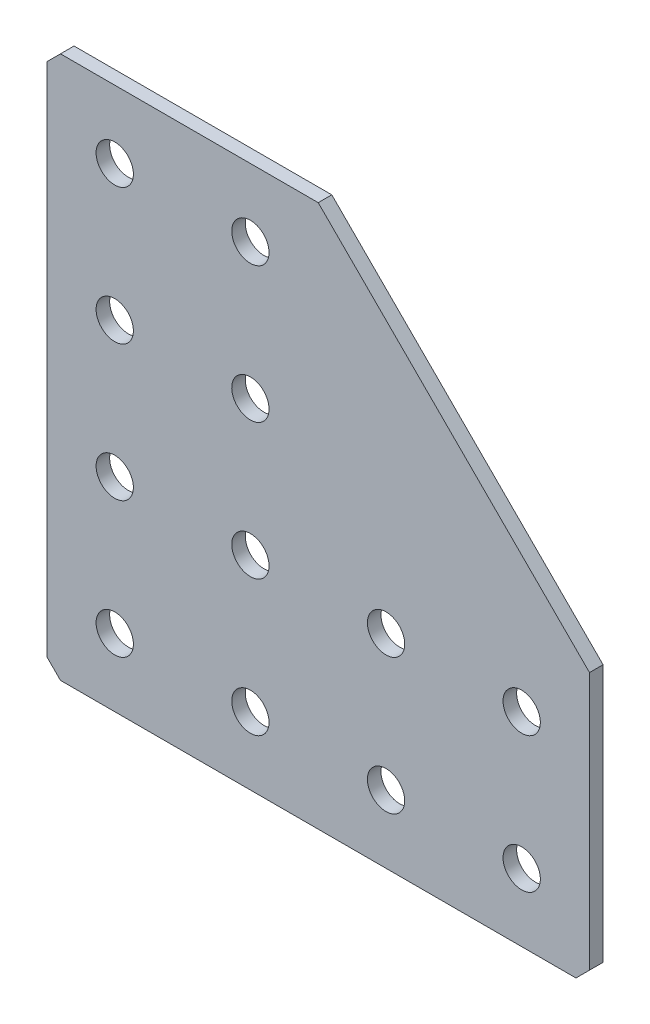
ISO-10303-21;
HEADER;
FILE_DESCRIPTION(('STEP AP214'),'2;1');
FILE_NAME('part.step','',(''),(''),'','','');
FILE_SCHEMA(('AUTOMOTIVE_DESIGN { 1 0 10303 214 1 1 1 1 }'));
ENDSEC;
DATA;
#1=APPLICATION_CONTEXT('core data for automotive mechanical design processes');
#2=APPLICATION_PROTOCOL_DEFINITION('international standard','automotive_design',2000,#1);
#3=PRODUCT_CONTEXT('',#1,'mechanical');
#4=PRODUCT('Part','Part','',(#3));
#5=PRODUCT_RELATED_PRODUCT_CATEGORY('part','',(#4));
#6=PRODUCT_DEFINITION_FORMATION('','',#4);
#7=PRODUCT_DEFINITION_CONTEXT('part definition',#1,'design');
#8=PRODUCT_DEFINITION('design','',#6,#7);
#9=PRODUCT_DEFINITION_SHAPE('','',#8);
#10=(LENGTH_UNIT() NAMED_UNIT(*) SI_UNIT(.MILLI.,.METRE.));
#11=(NAMED_UNIT(*) PLANE_ANGLE_UNIT() SI_UNIT($,.RADIAN.));
#12=(NAMED_UNIT(*) SI_UNIT($,.STERADIAN.) SOLID_ANGLE_UNIT());
#13=UNCERTAINTY_MEASURE_WITH_UNIT(LENGTH_MEASURE(1.E-05),#10,'distance_accuracy_value','');
#14=(GEOMETRIC_REPRESENTATION_CONTEXT(3) GLOBAL_UNCERTAINTY_ASSIGNED_CONTEXT((#13)) GLOBAL_UNIT_ASSIGNED_CONTEXT((#10,
#11,#12)) REPRESENTATION_CONTEXT('',''));
#15=CARTESIAN_POINT('',(0.,0.,0.));
#16=DIRECTION('',(0.,0.,1.));
#17=DIRECTION('',(1.,0.,0.));
#18=AXIS2_PLACEMENT_3D('',#15,#16,#17);
#19=CARTESIAN_POINT('',(0.,0.,-2.));
#20=DIRECTION('',(0.,0.,1.));
#21=DIRECTION('',(1.,0.,0.));
#22=AXIS2_PLACEMENT_3D('',#19,#20,#21);
#23=PLANE('',#22);
#24=CARTESIAN_POINT('',(10.,-50.,-2.));
#25=DIRECTION('',(0.,0.,-1.));
#26=DIRECTION('',(0.,1.,0.));
#27=AXIS2_PLACEMENT_3D('',#24,#25,#26);
#28=CIRCLE('',#27,2.75);
#29=CARTESIAN_POINT('',(10.,-47.25,-2.));
#30=VERTEX_POINT('',#29);
#31=EDGE_CURVE('E295',#30,#30,#28,.T.);
#32=ORIENTED_EDGE('',*,*,#31,.F.);
#33=EDGE_LOOP('',(#32));
#34=FACE_BOUND('',#33,.T.);
#35=CARTESIAN_POINT('',(10.,-30.,-2.));
#36=DIRECTION('',(0.,0.,-1.));
#37=DIRECTION('',(0.,1.,0.));
#38=AXIS2_PLACEMENT_3D('',#35,#36,#37);
#39=CIRCLE('',#38,2.75);
#40=CARTESIAN_POINT('',(10.,-27.25,-2.));
#41=VERTEX_POINT('',#40);
#42=EDGE_CURVE('E287',#41,#41,#39,.T.);
#43=ORIENTED_EDGE('',*,*,#42,.F.);
#44=EDGE_LOOP('',(#43));
#45=FACE_BOUND('',#44,.T.);
#46=CARTESIAN_POINT('',(10.,-9.99999999999999,-2.));
#47=DIRECTION('',(0.,0.,-1.));
#48=DIRECTION('',(0.,1.,0.));
#49=AXIS2_PLACEMENT_3D('',#46,#47,#48);
#50=CIRCLE('',#49,2.75);
#51=CARTESIAN_POINT('',(10.,-7.24999999999999,-2.));
#52=VERTEX_POINT('',#51);
#53=EDGE_CURVE('E279',#52,#52,#50,.T.);
#54=ORIENTED_EDGE('',*,*,#53,.F.);
#55=EDGE_LOOP('',(#54));
#56=FACE_BOUND('',#55,.T.);
#57=CARTESIAN_POINT('',(30.,-70.,-2.));
#58=DIRECTION('',(0.,0.,-1.));
#59=DIRECTION('',(0.,1.,0.));
#60=AXIS2_PLACEMENT_3D('',#57,#58,#59);
#61=CIRCLE('',#60,2.75);
#62=CARTESIAN_POINT('',(30.,-67.25,-2.));
#63=VERTEX_POINT('',#62);
#64=EDGE_CURVE('E271',#63,#63,#61,.T.);
#65=ORIENTED_EDGE('',*,*,#64,.F.);
#66=EDGE_LOOP('',(#65));
#67=FACE_BOUND('',#66,.T.);
#68=CARTESIAN_POINT('',(30.,-50.,-2.));
#69=DIRECTION('',(0.,0.,-1.));
#70=DIRECTION('',(0.,1.,0.));
#71=AXIS2_PLACEMENT_3D('',#68,#69,#70);
#72=CIRCLE('',#71,2.75);
#73=CARTESIAN_POINT('',(30.,-47.25,-2.));
#74=VERTEX_POINT('',#73);
#75=EDGE_CURVE('E263',#74,#74,#72,.T.);
#76=ORIENTED_EDGE('',*,*,#75,.F.);
#77=EDGE_LOOP('',(#76));
#78=FACE_BOUND('',#77,.T.);
#79=CARTESIAN_POINT('',(30.,-30.,-2.));
#80=DIRECTION('',(0.,0.,-1.));
#81=DIRECTION('',(0.,1.,0.));
#82=AXIS2_PLACEMENT_3D('',#79,#80,#81);
#83=CIRCLE('',#82,2.75);
#84=CARTESIAN_POINT('',(30.,-27.25,-2.));
#85=VERTEX_POINT('',#84);
#86=EDGE_CURVE('E255',#85,#85,#83,.T.);
#87=ORIENTED_EDGE('',*,*,#86,.F.);
#88=EDGE_LOOP('',(#87));
#89=FACE_BOUND('',#88,.T.);
#90=CARTESIAN_POINT('',(30.,-9.99999999999999,-2.));
#91=DIRECTION('',(0.,0.,-1.));
#92=DIRECTION('',(0.,1.,0.));
#93=AXIS2_PLACEMENT_3D('',#90,#91,#92);
#94=CIRCLE('',#93,2.75);
#95=CARTESIAN_POINT('',(30.,-7.24999999999999,-2.));
#96=VERTEX_POINT('',#95);
#97=EDGE_CURVE('E247',#96,#96,#94,.T.);
#98=ORIENTED_EDGE('',*,*,#97,.F.);
#99=EDGE_LOOP('',(#98));
#100=FACE_BOUND('',#99,.T.);
#101=CARTESIAN_POINT('',(50.,-70.,-2.));
#102=DIRECTION('',(0.,0.,-1.));
#103=DIRECTION('',(0.,1.,0.));
#104=AXIS2_PLACEMENT_3D('',#101,#102,#103);
#105=CIRCLE('',#104,2.75);
#106=CARTESIAN_POINT('',(50.,-67.25,-2.));
#107=VERTEX_POINT('',#106);
#108=EDGE_CURVE('E239',#107,#107,#105,.T.);
#109=ORIENTED_EDGE('',*,*,#108,.F.);
#110=EDGE_LOOP('',(#109));
#111=FACE_BOUND('',#110,.T.);
#112=CARTESIAN_POINT('',(50.,-50.,-2.));
#113=DIRECTION('',(0.,0.,-1.));
#114=DIRECTION('',(0.,1.,0.));
#115=AXIS2_PLACEMENT_3D('',#112,#113,#114);
#116=CIRCLE('',#115,2.75);
#117=CARTESIAN_POINT('',(50.,-47.25,-2.));
#118=VERTEX_POINT('',#117);
#119=EDGE_CURVE('E231',#118,#118,#116,.T.);
#120=ORIENTED_EDGE('',*,*,#119,.F.);
#121=EDGE_LOOP('',(#120));
#122=FACE_BOUND('',#121,.T.);
#123=CARTESIAN_POINT('',(70.,-70.,-2.));
#124=DIRECTION('',(0.,0.,-1.));
#125=DIRECTION('',(0.,1.,0.));
#126=AXIS2_PLACEMENT_3D('',#123,#124,#125);
#127=CIRCLE('',#126,2.75);
#128=CARTESIAN_POINT('',(70.,-67.25,-2.));
#129=VERTEX_POINT('',#128);
#130=EDGE_CURVE('E223',#129,#129,#127,.T.);
#131=ORIENTED_EDGE('',*,*,#130,.F.);
#132=EDGE_LOOP('',(#131));
#133=FACE_BOUND('',#132,.T.);
#134=CARTESIAN_POINT('',(70.,-50.,-2.));
#135=DIRECTION('',(0.,0.,-1.));
#136=DIRECTION('',(0.,1.,0.));
#137=AXIS2_PLACEMENT_3D('',#134,#135,#136);
#138=CIRCLE('',#137,2.75);
#139=CARTESIAN_POINT('',(70.,-47.25,-2.));
#140=VERTEX_POINT('',#139);
#141=EDGE_CURVE('E215',#140,#140,#138,.T.);
#142=ORIENTED_EDGE('',*,*,#141,.F.);
#143=EDGE_LOOP('',(#142));
#144=FACE_BOUND('',#143,.T.);
#145=DIRECTION('',(0.,1.,0.));
#146=VECTOR('',#145,1.);
#147=CARTESIAN_POINT('',(0.,0.,-2.));
#148=LINE('',#147,#146);
#149=CARTESIAN_POINT('',(0.,-78.,-2.));
#150=VERTEX_POINT('',#149);
#151=CARTESIAN_POINT('',(0.,-2.00000000000003,-2.));
#152=VERTEX_POINT('',#151);
#153=EDGE_CURVE('E147',#150,#152,#148,.T.);
#154=ORIENTED_EDGE('',*,*,#153,.T.);
#155=DIRECTION('',(-0.707106781186545,-0.70710678118655,0.));
#156=VECTOR('',#155,1.);
#157=CARTESIAN_POINT('',(2.00000000000002,0.,-2.));
#158=LINE('',#157,#156);
#159=CARTESIAN_POINT('',(2.00000000000002,0.,-2.));
#160=VERTEX_POINT('',#159);
#161=EDGE_CURVE('E116',#152,#160,#158,.F.);
#162=ORIENTED_EDGE('',*,*,#161,.T.);
#163=DIRECTION('',(1.,0.,0.));
#164=VECTOR('',#163,1.);
#165=CARTESIAN_POINT('',(40.,0.,-2.));
#166=LINE('',#165,#164);
#167=CARTESIAN_POINT('',(40.,0.,-2.));
#168=VERTEX_POINT('',#167);
#169=EDGE_CURVE('E109',#160,#168,#166,.T.);
#170=ORIENTED_EDGE('',*,*,#169,.T.);
#171=DIRECTION('',(0.707106781186548,-0.707106781186547,0.));
#172=VECTOR('',#171,1.);
#173=CARTESIAN_POINT('',(80.,-40.,-2.));
#174=LINE('',#173,#172);
#175=CARTESIAN_POINT('',(80.,-40.,-2.));
#176=VERTEX_POINT('',#175);
#177=EDGE_CURVE('E113',#168,#176,#174,.T.);
#178=ORIENTED_EDGE('',*,*,#177,.T.);
#179=DIRECTION('',(0.,-1.,0.));
#180=VECTOR('',#179,1.);
#181=CARTESIAN_POINT('',(80.,-80.,-2.));
#182=LINE('',#181,#180);
#183=CARTESIAN_POINT('',(80.,-78.,-2.));
#184=VERTEX_POINT('',#183);
#185=EDGE_CURVE('E132',#176,#184,#182,.T.);
#186=ORIENTED_EDGE('',*,*,#185,.T.);
#187=DIRECTION('',(0.707106781186548,0.707106781186548,0.));
#188=VECTOR('',#187,1.);
#189=CARTESIAN_POINT('',(78.,-80.,-2.));
#190=LINE('',#189,#188);
#191=CARTESIAN_POINT('',(78.,-80.,-2.));
#192=VERTEX_POINT('',#191);
#193=EDGE_CURVE('E67',#184,#192,#190,.F.);
#194=ORIENTED_EDGE('',*,*,#193,.T.);
#195=DIRECTION('',(-1.,0.,0.));
#196=VECTOR('',#195,1.);
#197=CARTESIAN_POINT('',(0.,-80.,-2.));
#198=LINE('',#197,#196);
#199=CARTESIAN_POINT('',(2.,-80.,-2.));
#200=VERTEX_POINT('',#199);
#201=EDGE_CURVE('E182',#192,#200,#198,.T.);
#202=ORIENTED_EDGE('',*,*,#201,.T.);
#203=DIRECTION('',(0.70710678118655,-0.707106781186545,0.));
#204=VECTOR('',#203,1.);
#205=CARTESIAN_POINT('',(0.,-78.,-2.));
#206=LINE('',#205,#204);
#207=EDGE_CURVE('E166',#200,#150,#206,.F.);
#208=ORIENTED_EDGE('',*,*,#207,.T.);
#209=EDGE_LOOP('',(#154,#162,#170,#178,#186,#194,#202,#208));
#210=FACE_BOUND('',#209,.T.);
#211=CARTESIAN_POINT('',(10.,-70.,-2.));
#212=DIRECTION('',(0.,0.,-1.));
#213=DIRECTION('',(0.,1.,0.));
#214=AXIS2_PLACEMENT_3D('',#211,#212,#213);
#215=CIRCLE('',#214,2.75);
#216=CARTESIAN_POINT('',(10.,-67.25,-2.));
#217=VERTEX_POINT('',#216);
#218=EDGE_CURVE('E303',#217,#217,#215,.T.);
#219=ORIENTED_EDGE('',*,*,#218,.F.);
#220=EDGE_LOOP('',(#219));
#221=FACE_BOUND('',#220,.T.);
#222=ADVANCED_FACE('F44',(#34,#45,#56,#67,#78,#89,#100,#111,#122,#133,#144,#210,#221),#23,.F.);
#223=CARTESIAN_POINT('',(0.,0.,0.));
#224=DIRECTION('',(0.,0.,1.));
#225=DIRECTION('',(1.,0.,0.));
#226=AXIS2_PLACEMENT_3D('',#223,#224,#225);
#227=PLANE('',#226);
#228=CARTESIAN_POINT('',(10.,-70.,0.));
#229=DIRECTION('',(0.,0.,-1.));
#230=DIRECTION('',(0.,1.,0.));
#231=AXIS2_PLACEMENT_3D('',#228,#229,#230);
#232=CIRCLE('',#231,2.75);
#233=CARTESIAN_POINT('',(10.,-67.25,0.));
#234=VERTEX_POINT('',#233);
#235=EDGE_CURVE('E299',#234,#234,#232,.T.);
#236=ORIENTED_EDGE('',*,*,#235,.T.);
#237=EDGE_LOOP('',(#236));
#238=FACE_BOUND('',#237,.T.);
#239=CARTESIAN_POINT('',(10.,-50.,0.));
#240=DIRECTION('',(0.,0.,-1.));
#241=DIRECTION('',(0.,1.,0.));
#242=AXIS2_PLACEMENT_3D('',#239,#240,#241);
#243=CIRCLE('',#242,2.75);
#244=CARTESIAN_POINT('',(10.,-47.25,0.));
#245=VERTEX_POINT('',#244);
#246=EDGE_CURVE('E291',#245,#245,#243,.T.);
#247=ORIENTED_EDGE('',*,*,#246,.T.);
#248=EDGE_LOOP('',(#247));
#249=FACE_BOUND('',#248,.T.);
#250=CARTESIAN_POINT('',(10.,-30.,0.));
#251=DIRECTION('',(0.,0.,-1.));
#252=DIRECTION('',(0.,1.,0.));
#253=AXIS2_PLACEMENT_3D('',#250,#251,#252);
#254=CIRCLE('',#253,2.75);
#255=CARTESIAN_POINT('',(10.,-27.25,0.));
#256=VERTEX_POINT('',#255);
#257=EDGE_CURVE('E283',#256,#256,#254,.T.);
#258=ORIENTED_EDGE('',*,*,#257,.T.);
#259=EDGE_LOOP('',(#258));
#260=FACE_BOUND('',#259,.T.);
#261=CARTESIAN_POINT('',(10.,-9.99999999999999,0.));
#262=DIRECTION('',(0.,0.,-1.));
#263=DIRECTION('',(0.,1.,0.));
#264=AXIS2_PLACEMENT_3D('',#261,#262,#263);
#265=CIRCLE('',#264,2.75);
#266=CARTESIAN_POINT('',(10.,-7.24999999999999,0.));
#267=VERTEX_POINT('',#266);
#268=EDGE_CURVE('E275',#267,#267,#265,.T.);
#269=ORIENTED_EDGE('',*,*,#268,.T.);
#270=EDGE_LOOP('',(#269));
#271=FACE_BOUND('',#270,.T.);
#272=DIRECTION('',(1.,0.,0.));
#273=VECTOR('',#272,1.);
#274=CARTESIAN_POINT('',(40.,0.,0.));
#275=LINE('',#274,#273);
#276=CARTESIAN_POINT('',(2.00000000000002,0.,0.));
#277=VERTEX_POINT('',#276);
#278=CARTESIAN_POINT('',(40.,0.,0.));
#279=VERTEX_POINT('',#278);
#280=EDGE_CURVE('E136',#277,#279,#275,.T.);
#281=ORIENTED_EDGE('',*,*,#280,.F.);
#282=DIRECTION('',(0.707106781186545,0.70710678118655,0.));
#283=VECTOR('',#282,1.);
#284=CARTESIAN_POINT('',(1.00000000000001,-1.00000000000001,0.));
#285=LINE('',#284,#283);
#286=CARTESIAN_POINT('',(0.,-2.00000000000003,0.));
#287=VERTEX_POINT('',#286);
#288=EDGE_CURVE('E156',#277,#287,#285,.F.);
#289=ORIENTED_EDGE('',*,*,#288,.T.);
#290=DIRECTION('',(0.,1.,0.));
#291=VECTOR('',#290,1.);
#292=CARTESIAN_POINT('',(0.,0.,0.));
#293=LINE('',#292,#291);
#294=CARTESIAN_POINT('',(0.,-78.,0.));
#295=VERTEX_POINT('',#294);
#296=EDGE_CURVE('E122',#295,#287,#293,.T.);
#297=ORIENTED_EDGE('',*,*,#296,.F.);
#298=DIRECTION('',(-0.70710678118655,0.707106781186545,0.));
#299=VECTOR('',#298,1.);
#300=CARTESIAN_POINT('',(-39.,-39.0000000000003,0.));
#301=LINE('',#300,#299);
#302=CARTESIAN_POINT('',(2.,-80.,0.));
#303=VERTEX_POINT('',#302);
#304=EDGE_CURVE('E145',#295,#303,#301,.F.);
#305=ORIENTED_EDGE('',*,*,#304,.T.);
#306=DIRECTION('',(-1.,0.,0.));
#307=VECTOR('',#306,1.);
#308=CARTESIAN_POINT('',(0.,-80.,0.));
#309=LINE('',#308,#307);
#310=CARTESIAN_POINT('',(78.,-80.,0.));
#311=VERTEX_POINT('',#310);
#312=EDGE_CURVE('E181',#311,#303,#309,.T.);
#313=ORIENTED_EDGE('',*,*,#312,.F.);
#314=DIRECTION('',(-0.707106781186548,-0.707106781186548,0.));
#315=VECTOR('',#314,1.);
#316=CARTESIAN_POINT('',(79.,-79.,0.));
#317=LINE('',#316,#315);
#318=CARTESIAN_POINT('',(80.,-78.,0.));
#319=VERTEX_POINT('',#318);
#320=EDGE_CURVE('E153',#311,#319,#317,.F.);
#321=ORIENTED_EDGE('',*,*,#320,.T.);
#322=DIRECTION('',(0.,-1.,0.));
#323=VECTOR('',#322,1.);
#324=CARTESIAN_POINT('',(80.,-80.,0.));
#325=LINE('',#324,#323);
#326=CARTESIAN_POINT('',(80.,-40.,0.));
#327=VERTEX_POINT('',#326);
#328=EDGE_CURVE('E191',#327,#319,#325,.T.);
#329=ORIENTED_EDGE('',*,*,#328,.F.);
#330=DIRECTION('',(0.707106781186548,-0.707106781186547,0.));
#331=VECTOR('',#330,1.);
#332=CARTESIAN_POINT('',(80.,-40.,0.));
#333=LINE('',#332,#331);
#334=EDGE_CURVE('E198',#279,#327,#333,.T.);
#335=ORIENTED_EDGE('',*,*,#334,.F.);
#336=EDGE_LOOP('',(#281,#289,#297,#305,#313,#321,#329,#335));
#337=FACE_BOUND('',#336,.T.);
#338=CARTESIAN_POINT('',(70.,-50.,0.));
#339=DIRECTION('',(0.,0.,-1.));
#340=DIRECTION('',(0.,1.,0.));
#341=AXIS2_PLACEMENT_3D('',#338,#339,#340);
#342=CIRCLE('',#341,2.75);
#343=CARTESIAN_POINT('',(70.,-47.25,0.));
#344=VERTEX_POINT('',#343);
#345=EDGE_CURVE('E205',#344,#344,#342,.T.);
#346=ORIENTED_EDGE('',*,*,#345,.T.);
#347=EDGE_LOOP('',(#346));
#348=FACE_BOUND('',#347,.T.);
#349=CARTESIAN_POINT('',(70.,-70.,0.));
#350=DIRECTION('',(0.,0.,-1.));
#351=DIRECTION('',(0.,1.,0.));
#352=AXIS2_PLACEMENT_3D('',#349,#350,#351);
#353=CIRCLE('',#352,2.75);
#354=CARTESIAN_POINT('',(70.,-67.25,0.));
#355=VERTEX_POINT('',#354);
#356=EDGE_CURVE('E219',#355,#355,#353,.T.);
#357=ORIENTED_EDGE('',*,*,#356,.T.);
#358=EDGE_LOOP('',(#357));
#359=FACE_BOUND('',#358,.T.);
#360=CARTESIAN_POINT('',(50.,-50.,0.));
#361=DIRECTION('',(0.,0.,-1.));
#362=DIRECTION('',(0.,1.,0.));
#363=AXIS2_PLACEMENT_3D('',#360,#361,#362);
#364=CIRCLE('',#363,2.75);
#365=CARTESIAN_POINT('',(50.,-47.25,0.));
#366=VERTEX_POINT('',#365);
#367=EDGE_CURVE('E227',#366,#366,#364,.T.);
#368=ORIENTED_EDGE('',*,*,#367,.T.);
#369=EDGE_LOOP('',(#368));
#370=FACE_BOUND('',#369,.T.);
#371=CARTESIAN_POINT('',(50.,-70.,0.));
#372=DIRECTION('',(0.,0.,-1.));
#373=DIRECTION('',(0.,1.,0.));
#374=AXIS2_PLACEMENT_3D('',#371,#372,#373);
#375=CIRCLE('',#374,2.75);
#376=CARTESIAN_POINT('',(50.,-67.25,0.));
#377=VERTEX_POINT('',#376);
#378=EDGE_CURVE('E235',#377,#377,#375,.T.);
#379=ORIENTED_EDGE('',*,*,#378,.T.);
#380=EDGE_LOOP('',(#379));
#381=FACE_BOUND('',#380,.T.);
#382=CARTESIAN_POINT('',(30.,-9.99999999999999,0.));
#383=DIRECTION('',(0.,0.,-1.));
#384=DIRECTION('',(0.,1.,0.));
#385=AXIS2_PLACEMENT_3D('',#382,#383,#384);
#386=CIRCLE('',#385,2.75);
#387=CARTESIAN_POINT('',(30.,-7.24999999999999,0.));
#388=VERTEX_POINT('',#387);
#389=EDGE_CURVE('E243',#388,#388,#386,.T.);
#390=ORIENTED_EDGE('',*,*,#389,.T.);
#391=EDGE_LOOP('',(#390));
#392=FACE_BOUND('',#391,.T.);
#393=CARTESIAN_POINT('',(30.,-30.,0.));
#394=DIRECTION('',(0.,0.,-1.));
#395=DIRECTION('',(0.,1.,0.));
#396=AXIS2_PLACEMENT_3D('',#393,#394,#395);
#397=CIRCLE('',#396,2.75);
#398=CARTESIAN_POINT('',(30.,-27.25,0.));
#399=VERTEX_POINT('',#398);
#400=EDGE_CURVE('E251',#399,#399,#397,.T.);
#401=ORIENTED_EDGE('',*,*,#400,.T.);
#402=EDGE_LOOP('',(#401));
#403=FACE_BOUND('',#402,.T.);
#404=CARTESIAN_POINT('',(30.,-50.,0.));
#405=DIRECTION('',(0.,0.,-1.));
#406=DIRECTION('',(0.,1.,0.));
#407=AXIS2_PLACEMENT_3D('',#404,#405,#406);
#408=CIRCLE('',#407,2.75);
#409=CARTESIAN_POINT('',(30.,-47.25,0.));
#410=VERTEX_POINT('',#409);
#411=EDGE_CURVE('E259',#410,#410,#408,.T.);
#412=ORIENTED_EDGE('',*,*,#411,.T.);
#413=EDGE_LOOP('',(#412));
#414=FACE_BOUND('',#413,.T.);
#415=CARTESIAN_POINT('',(30.,-70.,0.));
#416=DIRECTION('',(0.,0.,-1.));
#417=DIRECTION('',(0.,1.,0.));
#418=AXIS2_PLACEMENT_3D('',#415,#416,#417);
#419=CIRCLE('',#418,2.75);
#420=CARTESIAN_POINT('',(30.,-67.25,0.));
#421=VERTEX_POINT('',#420);
#422=EDGE_CURVE('E267',#421,#421,#419,.T.);
#423=ORIENTED_EDGE('',*,*,#422,.T.);
#424=EDGE_LOOP('',(#423));
#425=FACE_BOUND('',#424,.T.);
#426=ADVANCED_FACE('F185',(#238,#249,#260,#271,#337,#348,#359,#370,#381,#392,#403,#414,#425),
#227,.T.);
#427=CARTESIAN_POINT('',(40.,0.,-2.));
#428=DIRECTION('',(0.,-1.,0.));
#429=DIRECTION('',(1.,0.,0.));
#430=AXIS2_PLACEMENT_3D('',#427,#428,#429);
#431=PLANE('',#430);
#432=ORIENTED_EDGE('',*,*,#169,.F.);
#433=DIRECTION('',(0.,0.,1.));
#434=VECTOR('',#433,1.);
#435=CARTESIAN_POINT('',(2.00000000000002,0.,-2.));
#436=LINE('',#435,#434);
#437=EDGE_CURVE('E139',#160,#277,#436,.T.);
#438=ORIENTED_EDGE('',*,*,#437,.T.);
#439=ORIENTED_EDGE('',*,*,#280,.T.);
#440=DIRECTION('',(0.,0.,1.));
#441=VECTOR('',#440,1.);
#442=CARTESIAN_POINT('',(40.,0.,-2.));
#443=LINE('',#442,#441);
#444=EDGE_CURVE('E127',#168,#279,#443,.T.);
#445=ORIENTED_EDGE('',*,*,#444,.F.);
#446=EDGE_LOOP('',(#432,#438,#439,#445));
#447=FACE_BOUND('',#446,.T.);
#448=ADVANCED_FACE('F134',(#447),#431,.F.);
#449=CARTESIAN_POINT('',(80.,-40.,-2.));
#450=DIRECTION('',(-0.707106781186547,-0.707106781186548,0.));
#451=DIRECTION('',(0.707106781186548,-0.707106781186547,0.));
#452=AXIS2_PLACEMENT_3D('',#449,#450,#451);
#453=PLANE('',#452);
#454=ORIENTED_EDGE('',*,*,#334,.T.);
#455=DIRECTION('',(0.,0.,1.));
#456=VECTOR('',#455,1.);
#457=CARTESIAN_POINT('',(80.,-40.,-2.));
#458=LINE('',#457,#456);
#459=EDGE_CURVE('E129',#176,#327,#458,.T.);
#460=ORIENTED_EDGE('',*,*,#459,.F.);
#461=ORIENTED_EDGE('',*,*,#177,.F.);
#462=ORIENTED_EDGE('',*,*,#444,.T.);
#463=EDGE_LOOP('',(#454,#460,#461,#462));
#464=FACE_BOUND('',#463,.T.);
#465=ADVANCED_FACE('F126',(#464),#453,.F.);
#466=CARTESIAN_POINT('',(80.,-80.,-2.));
#467=DIRECTION('',(-1.,0.,0.));
#468=DIRECTION('',(0.,-1.,0.));
#469=AXIS2_PLACEMENT_3D('',#466,#467,#468);
#470=PLANE('',#469);
#471=ORIENTED_EDGE('',*,*,#328,.T.);
#472=DIRECTION('',(0.,0.,-1.));
#473=VECTOR('',#472,1.);
#474=CARTESIAN_POINT('',(80.,-78.,-2.));
#475=LINE('',#474,#473);
#476=EDGE_CURVE('E11',#319,#184,#475,.T.);
#477=ORIENTED_EDGE('',*,*,#476,.T.);
#478=ORIENTED_EDGE('',*,*,#185,.F.);
#479=ORIENTED_EDGE('',*,*,#459,.T.);
#480=EDGE_LOOP('',(#471,#477,#478,#479));
#481=FACE_BOUND('',#480,.T.);
#482=ADVANCED_FACE('F331',(#481),#470,.F.);
#483=CARTESIAN_POINT('',(0.,-80.,-2.));
#484=DIRECTION('',(0.,1.,0.));
#485=DIRECTION('',(0.,0.,1.));
#486=AXIS2_PLACEMENT_3D('',#483,#484,#485);
#487=PLANE('',#486);
#488=ORIENTED_EDGE('',*,*,#201,.F.);
#489=DIRECTION('',(0.,0.,1.));
#490=VECTOR('',#489,1.);
#491=CARTESIAN_POINT('',(78.,-80.,-2.));
#492=LINE('',#491,#490);
#493=EDGE_CURVE('E53',#192,#311,#492,.T.);
#494=ORIENTED_EDGE('',*,*,#493,.T.);
#495=ORIENTED_EDGE('',*,*,#312,.T.);
#496=DIRECTION('',(0.,0.,-1.));
#497=VECTOR('',#496,1.);
#498=CARTESIAN_POINT('',(2.,-80.,-2.));
#499=LINE('',#498,#497);
#500=EDGE_CURVE('E60',#303,#200,#499,.T.);
#501=ORIENTED_EDGE('',*,*,#500,.T.);
#502=EDGE_LOOP('',(#488,#494,#495,#501));
#503=FACE_BOUND('',#502,.T.);
#504=ADVANCED_FACE('F180',(#503),#487,.F.);
#505=CARTESIAN_POINT('',(0.,0.,-2.));
#506=DIRECTION('',(1.,0.,0.));
#507=DIRECTION('',(0.,0.,-1.));
#508=AXIS2_PLACEMENT_3D('',#505,#506,#507);
#509=PLANE('',#508);
#510=ORIENTED_EDGE('',*,*,#296,.T.);
#511=DIRECTION('',(0.,0.,-1.));
#512=VECTOR('',#511,1.);
#513=CARTESIAN_POINT('',(0.,-2.00000000000003,-2.));
#514=LINE('',#513,#512);
#515=EDGE_CURVE('E163',#287,#152,#514,.T.);
#516=ORIENTED_EDGE('',*,*,#515,.T.);
#517=ORIENTED_EDGE('',*,*,#153,.F.);
#518=DIRECTION('',(0.,0.,1.));
#519=VECTOR('',#518,1.);
#520=CARTESIAN_POINT('',(0.,-78.,-2.));
#521=LINE('',#520,#519);
#522=EDGE_CURVE('E159',#150,#295,#521,.T.);
#523=ORIENTED_EDGE('',*,*,#522,.T.);
#524=EDGE_LOOP('',(#510,#516,#517,#523));
#525=FACE_BOUND('',#524,.T.);
#526=ADVANCED_FACE('F325',(#525),#509,.F.);
#527=CARTESIAN_POINT('',(70.,-50.,-2.));
#528=DIRECTION('',(0.,0.,-1.));
#529=DIRECTION('',(0.,1.,0.));
#530=AXIS2_PLACEMENT_3D('',#527,#528,#529);
#531=CYLINDRICAL_SURFACE('',#530,2.75);
#532=ORIENTED_EDGE('',*,*,#345,.F.);
#533=EDGE_LOOP('',(#532));
#534=FACE_BOUND('',#533,.T.);
#535=ORIENTED_EDGE('',*,*,#141,.T.);
#536=EDGE_LOOP('',(#535));
#537=FACE_BOUND('',#536,.T.);
#538=ADVANCED_FACE('F322',(#534,#537),#531,.F.);
#539=CARTESIAN_POINT('',(70.,-70.,-2.));
#540=DIRECTION('',(0.,0.,-1.));
#541=DIRECTION('',(0.,1.,0.));
#542=AXIS2_PLACEMENT_3D('',#539,#540,#541);
#543=CYLINDRICAL_SURFACE('',#542,2.75);
#544=ORIENTED_EDGE('',*,*,#356,.F.);
#545=EDGE_LOOP('',(#544));
#546=FACE_BOUND('',#545,.T.);
#547=ORIENTED_EDGE('',*,*,#130,.T.);
#548=EDGE_LOOP('',(#547));
#549=FACE_BOUND('',#548,.T.);
#550=ADVANCED_FACE('F452',(#546,#549),#543,.F.);
#551=CARTESIAN_POINT('',(50.,-50.,-2.));
#552=DIRECTION('',(0.,0.,-1.));
#553=DIRECTION('',(0.,1.,0.));
#554=AXIS2_PLACEMENT_3D('',#551,#552,#553);
#555=CYLINDRICAL_SURFACE('',#554,2.75);
#556=ORIENTED_EDGE('',*,*,#367,.F.);
#557=EDGE_LOOP('',(#556));
#558=FACE_BOUND('',#557,.T.);
#559=ORIENTED_EDGE('',*,*,#119,.T.);
#560=EDGE_LOOP('',(#559));
#561=FACE_BOUND('',#560,.T.);
#562=ADVANCED_FACE('F443',(#558,#561),#555,.F.);
#563=CARTESIAN_POINT('',(50.,-70.,-2.));
#564=DIRECTION('',(0.,0.,-1.));
#565=DIRECTION('',(0.,1.,0.));
#566=AXIS2_PLACEMENT_3D('',#563,#564,#565);
#567=CYLINDRICAL_SURFACE('',#566,2.75);
#568=ORIENTED_EDGE('',*,*,#378,.F.);
#569=EDGE_LOOP('',(#568));
#570=FACE_BOUND('',#569,.T.);
#571=ORIENTED_EDGE('',*,*,#108,.T.);
#572=EDGE_LOOP('',(#571));
#573=FACE_BOUND('',#572,.T.);
#574=ADVANCED_FACE('F434',(#570,#573),#567,.F.);
#575=CARTESIAN_POINT('',(30.,-9.99999999999999,-2.));
#576=DIRECTION('',(0.,0.,-1.));
#577=DIRECTION('',(0.,1.,0.));
#578=AXIS2_PLACEMENT_3D('',#575,#576,#577);
#579=CYLINDRICAL_SURFACE('',#578,2.75);
#580=ORIENTED_EDGE('',*,*,#389,.F.);
#581=EDGE_LOOP('',(#580));
#582=FACE_BOUND('',#581,.T.);
#583=ORIENTED_EDGE('',*,*,#97,.T.);
#584=EDGE_LOOP('',(#583));
#585=FACE_BOUND('',#584,.T.);
#586=ADVANCED_FACE('F425',(#582,#585),#579,.F.);
#587=CARTESIAN_POINT('',(30.,-30.,-2.));
#588=DIRECTION('',(0.,0.,-1.));
#589=DIRECTION('',(0.,1.,0.));
#590=AXIS2_PLACEMENT_3D('',#587,#588,#589);
#591=CYLINDRICAL_SURFACE('',#590,2.75);
#592=ORIENTED_EDGE('',*,*,#400,.F.);
#593=EDGE_LOOP('',(#592));
#594=FACE_BOUND('',#593,.T.);
#595=ORIENTED_EDGE('',*,*,#86,.T.);
#596=EDGE_LOOP('',(#595));
#597=FACE_BOUND('',#596,.T.);
#598=ADVANCED_FACE('F416',(#594,#597),#591,.F.);
#599=CARTESIAN_POINT('',(30.,-50.,-2.));
#600=DIRECTION('',(0.,0.,-1.));
#601=DIRECTION('',(0.,1.,0.));
#602=AXIS2_PLACEMENT_3D('',#599,#600,#601);
#603=CYLINDRICAL_SURFACE('',#602,2.75);
#604=ORIENTED_EDGE('',*,*,#411,.F.);
#605=EDGE_LOOP('',(#604));
#606=FACE_BOUND('',#605,.T.);
#607=ORIENTED_EDGE('',*,*,#75,.T.);
#608=EDGE_LOOP('',(#607));
#609=FACE_BOUND('',#608,.T.);
#610=ADVANCED_FACE('F407',(#606,#609),#603,.F.);
#611=CARTESIAN_POINT('',(30.,-70.,-2.));
#612=DIRECTION('',(0.,0.,-1.));
#613=DIRECTION('',(0.,1.,0.));
#614=AXIS2_PLACEMENT_3D('',#611,#612,#613);
#615=CYLINDRICAL_SURFACE('',#614,2.75);
#616=ORIENTED_EDGE('',*,*,#422,.F.);
#617=EDGE_LOOP('',(#616));
#618=FACE_BOUND('',#617,.T.);
#619=ORIENTED_EDGE('',*,*,#64,.T.);
#620=EDGE_LOOP('',(#619));
#621=FACE_BOUND('',#620,.T.);
#622=ADVANCED_FACE('F398',(#618,#621),#615,.F.);
#623=CARTESIAN_POINT('',(10.,-9.99999999999999,-2.));
#624=DIRECTION('',(0.,0.,-1.));
#625=DIRECTION('',(0.,1.,0.));
#626=AXIS2_PLACEMENT_3D('',#623,#624,#625);
#627=CYLINDRICAL_SURFACE('',#626,2.75);
#628=ORIENTED_EDGE('',*,*,#268,.F.);
#629=EDGE_LOOP('',(#628));
#630=FACE_BOUND('',#629,.T.);
#631=ORIENTED_EDGE('',*,*,#53,.T.);
#632=EDGE_LOOP('',(#631));
#633=FACE_BOUND('',#632,.T.);
#634=ADVANCED_FACE('F389',(#630,#633),#627,.F.);
#635=CARTESIAN_POINT('',(10.,-30.,-2.));
#636=DIRECTION('',(0.,0.,-1.));
#637=DIRECTION('',(0.,1.,0.));
#638=AXIS2_PLACEMENT_3D('',#635,#636,#637);
#639=CYLINDRICAL_SURFACE('',#638,2.75);
#640=ORIENTED_EDGE('',*,*,#257,.F.);
#641=EDGE_LOOP('',(#640));
#642=FACE_BOUND('',#641,.T.);
#643=ORIENTED_EDGE('',*,*,#42,.T.);
#644=EDGE_LOOP('',(#643));
#645=FACE_BOUND('',#644,.T.);
#646=ADVANCED_FACE('F380',(#642,#645),#639,.F.);
#647=CARTESIAN_POINT('',(10.,-50.,-2.));
#648=DIRECTION('',(0.,0.,-1.));
#649=DIRECTION('',(0.,1.,0.));
#650=AXIS2_PLACEMENT_3D('',#647,#648,#649);
#651=CYLINDRICAL_SURFACE('',#650,2.75);
#652=ORIENTED_EDGE('',*,*,#246,.F.);
#653=EDGE_LOOP('',(#652));
#654=FACE_BOUND('',#653,.T.);
#655=ORIENTED_EDGE('',*,*,#31,.T.);
#656=EDGE_LOOP('',(#655));
#657=FACE_BOUND('',#656,.T.);
#658=ADVANCED_FACE('F371',(#654,#657),#651,.F.);
#659=CARTESIAN_POINT('',(10.,-70.,-2.));
#660=DIRECTION('',(0.,0.,-1.));
#661=DIRECTION('',(0.,1.,0.));
#662=AXIS2_PLACEMENT_3D('',#659,#660,#661);
#663=CYLINDRICAL_SURFACE('',#662,2.75);
#664=ORIENTED_EDGE('',*,*,#235,.F.);
#665=EDGE_LOOP('',(#664));
#666=FACE_BOUND('',#665,.T.);
#667=ORIENTED_EDGE('',*,*,#218,.T.);
#668=EDGE_LOOP('',(#667));
#669=FACE_BOUND('',#668,.T.);
#670=ADVANCED_FACE('F310',(#666,#669),#663,.F.);
#671=CARTESIAN_POINT('',(2.00000000000002,0.,-2.));
#672=DIRECTION('',(0.70710678118655,-0.707106781186545,0.));
#673=DIRECTION('',(0.,0.,1.));
#674=AXIS2_PLACEMENT_3D('',#671,#672,#673);
#675=PLANE('',#674);
#676=ORIENTED_EDGE('',*,*,#161,.F.);
#677=ORIENTED_EDGE('',*,*,#515,.F.);
#678=ORIENTED_EDGE('',*,*,#288,.F.);
#679=ORIENTED_EDGE('',*,*,#437,.F.);
#680=EDGE_LOOP('',(#676,#677,#678,#679));
#681=FACE_BOUND('',#680,.T.);
#682=ADVANCED_FACE('F339',(#681),#675,.F.);
#683=CARTESIAN_POINT('',(78.,-80.,-2.));
#684=DIRECTION('',(-0.707106781186547,0.707106781186547,0.));
#685=DIRECTION('',(0.,0.,1.));
#686=AXIS2_PLACEMENT_3D('',#683,#684,#685);
#687=PLANE('',#686);
#688=ORIENTED_EDGE('',*,*,#193,.F.);
#689=ORIENTED_EDGE('',*,*,#476,.F.);
#690=ORIENTED_EDGE('',*,*,#320,.F.);
#691=ORIENTED_EDGE('',*,*,#493,.F.);
#692=EDGE_LOOP('',(#688,#689,#690,#691));
#693=FACE_BOUND('',#692,.T.);
#694=ADVANCED_FACE('F341',(#693),#687,.F.);
#695=CARTESIAN_POINT('',(0.,-78.,-2.));
#696=DIRECTION('',(0.707106781186545,0.70710678118655,0.));
#697=DIRECTION('',(0.,0.,1.));
#698=AXIS2_PLACEMENT_3D('',#695,#696,#697);
#699=PLANE('',#698);
#700=ORIENTED_EDGE('',*,*,#207,.F.);
#701=ORIENTED_EDGE('',*,*,#500,.F.);
#702=ORIENTED_EDGE('',*,*,#304,.F.);
#703=ORIENTED_EDGE('',*,*,#522,.F.);
#704=EDGE_LOOP('',(#700,#701,#702,#703));
#705=FACE_BOUND('',#704,.T.);
#706=ADVANCED_FACE('F46',(#705),#699,.F.);
#707=CLOSED_SHELL('',(#222,#426,#448,#465,#482,#504,#526,#538,#550,#562,#574,#586,#598,#610,
#622,#634,#646,#658,#670,#682,#694,#706));
#708=MANIFOLD_SOLID_BREP('B2',#707);
#709=ADVANCED_BREP_SHAPE_REPRESENTATION('',(#18,#708),#14);
#710=SHAPE_DEFINITION_REPRESENTATION(#9,#709);
ENDSEC;
END-ISO-10303-21;
